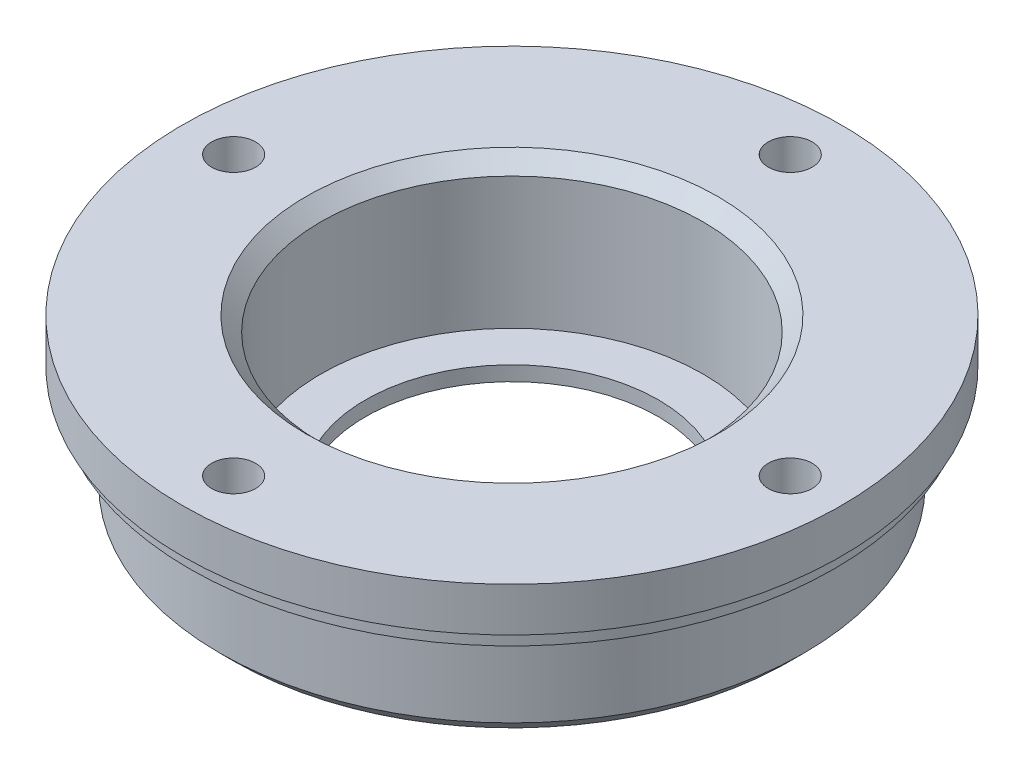
ISO-10303-21;
HEADER;
FILE_DESCRIPTION(('STEP AP214'),'2;1');
FILE_NAME('part.step','',(''),(''),'','','');
FILE_SCHEMA(('AUTOMOTIVE_DESIGN { 1 0 10303 214 1 1 1 1 }'));
ENDSEC;
DATA;
#1=APPLICATION_CONTEXT('core data for automotive mechanical design processes');
#2=APPLICATION_PROTOCOL_DEFINITION('international standard','automotive_design',2000,#1);
#3=PRODUCT_CONTEXT('',#1,'mechanical');
#4=PRODUCT('Part','Part','',(#3));
#5=PRODUCT_RELATED_PRODUCT_CATEGORY('part','',(#4));
#6=PRODUCT_DEFINITION_FORMATION('','',#4);
#7=PRODUCT_DEFINITION_CONTEXT('part definition',#1,'design');
#8=PRODUCT_DEFINITION('design','',#6,#7);
#9=PRODUCT_DEFINITION_SHAPE('','',#8);
#10=(LENGTH_UNIT() NAMED_UNIT(*) SI_UNIT(.MILLI.,.METRE.));
#11=(NAMED_UNIT(*) PLANE_ANGLE_UNIT() SI_UNIT($,.RADIAN.));
#12=(NAMED_UNIT(*) SI_UNIT($,.STERADIAN.) SOLID_ANGLE_UNIT());
#13=UNCERTAINTY_MEASURE_WITH_UNIT(LENGTH_MEASURE(1.E-05),#10,'distance_accuracy_value','');
#14=(GEOMETRIC_REPRESENTATION_CONTEXT(3) GLOBAL_UNCERTAINTY_ASSIGNED_CONTEXT((#13)) GLOBAL_UNIT_ASSIGNED_CONTEXT((#10,
#11,#12)) REPRESENTATION_CONTEXT('',''));
#15=CARTESIAN_POINT('',(0.,0.,0.));
#16=DIRECTION('',(0.,0.,1.));
#17=DIRECTION('',(1.,0.,0.));
#18=AXIS2_PLACEMENT_3D('',#15,#16,#17);
#19=CARTESIAN_POINT('',(0.,7.,0.));
#20=DIRECTION('',(0.,-1.,0.));
#21=DIRECTION('',(0.,0.,-1.));
#22=AXIS2_PLACEMENT_3D('',#19,#20,#21);
#23=CYLINDRICAL_SURFACE('',#22,13.05);
#24=CARTESIAN_POINT('',(0.,9.99999999999999,0.));
#25=DIRECTION('',(0.,1.,0.));
#26=DIRECTION('',(0.,0.,1.));
#27=AXIS2_PLACEMENT_3D('',#24,#25,#26);
#28=CIRCLE('',#27,13.05);
#29=CARTESIAN_POINT('',(0.,9.99999999999999,13.05));
#30=VERTEX_POINT('',#29);
#31=EDGE_CURVE('E120',#30,#30,#28,.T.);
#32=ORIENTED_EDGE('',*,*,#31,.T.);
#33=EDGE_LOOP('',(#32));
#34=FACE_BOUND('',#33,.T.);
#35=CARTESIAN_POINT('',(0.,1.,0.));
#36=DIRECTION('',(0.,-1.,0.));
#37=DIRECTION('',(0.,0.,-1.));
#38=AXIS2_PLACEMENT_3D('',#35,#36,#37);
#39=CIRCLE('',#38,13.05);
#40=CARTESIAN_POINT('',(0.,1.,-13.05));
#41=VERTEX_POINT('',#40);
#42=EDGE_CURVE('E113',#41,#41,#39,.T.);
#43=ORIENTED_EDGE('',*,*,#42,.T.);
#44=EDGE_LOOP('',(#43));
#45=FACE_BOUND('',#44,.T.);
#46=ADVANCED_FACE('F39',(#34,#45),#23,.F.);
#47=CARTESIAN_POINT('',(0.,0.,0.));
#48=DIRECTION('',(0.,1.,0.));
#49=DIRECTION('',(0.,0.,1.));
#50=AXIS2_PLACEMENT_3D('',#47,#48,#49);
#51=PLANE('',#50);
#52=CARTESIAN_POINT('',(0.,0.,0.));
#53=DIRECTION('',(0.,1.,0.));
#54=DIRECTION('',(0.,0.,1.));
#55=AXIS2_PLACEMENT_3D('',#52,#53,#54);
#56=CIRCLE('',#55,18.95);
#57=CARTESIAN_POINT('',(0.,0.,18.95));
#58=VERTEX_POINT('',#57);
#59=EDGE_CURVE('E117',#58,#58,#56,.F.);
#60=ORIENTED_EDGE('',*,*,#59,.T.);
#61=EDGE_LOOP('',(#60));
#62=FACE_BOUND('',#61,.T.);
#63=CARTESIAN_POINT('',(0.,0.,0.));
#64=DIRECTION('',(0.,-1.,0.));
#65=DIRECTION('',(0.,0.,-1.));
#66=AXIS2_PLACEMENT_3D('',#63,#64,#65);
#67=CIRCLE('',#66,10.);
#68=CARTESIAN_POINT('',(0.,0.,-10.));
#69=VERTEX_POINT('',#68);
#70=EDGE_CURVE('E144',#69,#69,#67,.T.);
#71=ORIENTED_EDGE('',*,*,#70,.F.);
#72=EDGE_LOOP('',(#71));
#73=FACE_BOUND('',#72,.T.);
#74=ADVANCED_FACE('F135',(#62,#73),#51,.F.);
#75=CARTESIAN_POINT('',(0.,7.,0.));
#76=DIRECTION('',(0.,-1.,0.));
#77=DIRECTION('',(0.,0.,-1.));
#78=AXIS2_PLACEMENT_3D('',#75,#76,#77);
#79=CYLINDRICAL_SURFACE('',#78,19.95);
#80=CARTESIAN_POINT('',(0.,1.00000000000001,0.));
#81=DIRECTION('',(0.,1.,0.));
#82=DIRECTION('',(0.,0.,1.));
#83=AXIS2_PLACEMENT_3D('',#80,#81,#82);
#84=CIRCLE('',#83,19.95);
#85=CARTESIAN_POINT('',(0.,1.00000000000001,19.95));
#86=VERTEX_POINT('',#85);
#87=EDGE_CURVE('E111',#86,#86,#84,.T.);
#88=ORIENTED_EDGE('',*,*,#87,.T.);
#89=EDGE_LOOP('',(#88));
#90=FACE_BOUND('',#89,.T.);
#91=CARTESIAN_POINT('',(0.,7.,0.));
#92=DIRECTION('',(0.,1.,0.));
#93=DIRECTION('',(0.,0.,1.));
#94=AXIS2_PLACEMENT_3D('',#91,#92,#93);
#95=CIRCLE('',#94,19.95);
#96=CARTESIAN_POINT('',(1.18895649671302,7.,19.9145394736841));
#97=VERTEX_POINT('',#96);
#98=CARTESIAN_POINT('',(19.9145394736842,7.,1.18895649671174));
#99=VERTEX_POINT('',#98);
#100=EDGE_CURVE('E108',#97,#99,#95,.T.);
#101=ORIENTED_EDGE('',*,*,#100,.F.);
#102=CARTESIAN_POINT('',(-1.18895649671069,7.,19.9145394736843));
#103=VERTEX_POINT('',#102);
#104=EDGE_CURVE('E112',#103,#97,#95,.T.);
#105=ORIENTED_EDGE('',*,*,#104,.F.);
#106=CARTESIAN_POINT('',(-19.9145394736842,7.,1.18895649671198));
#107=VERTEX_POINT('',#106);
#108=EDGE_CURVE('E142',#107,#103,#95,.T.);
#109=ORIENTED_EDGE('',*,*,#108,.F.);
#110=CARTESIAN_POINT('',(-19.9145394736843,7.,-1.18895649671082));
#111=VERTEX_POINT('',#110);
#112=EDGE_CURVE('E184',#111,#107,#95,.T.);
#113=ORIENTED_EDGE('',*,*,#112,.F.);
#114=CARTESIAN_POINT('',(-1.18895649671184,7.,-19.9145394736842));
#115=VERTEX_POINT('',#114);
#116=EDGE_CURVE('E98',#115,#111,#95,.T.);
#117=ORIENTED_EDGE('',*,*,#116,.F.);
#118=CARTESIAN_POINT('',(1.18895649671187,7.,-19.9145394736842));
#119=VERTEX_POINT('',#118);
#120=EDGE_CURVE('E81',#119,#115,#95,.T.);
#121=ORIENTED_EDGE('',*,*,#120,.F.);
#122=CARTESIAN_POINT('',(19.9145394736842,7.,-1.18895649671291));
#123=VERTEX_POINT('',#122);
#124=EDGE_CURVE('E96',#123,#119,#95,.T.);
#125=ORIENTED_EDGE('',*,*,#124,.F.);
#126=EDGE_CURVE('E106',#99,#123,#95,.T.);
#127=ORIENTED_EDGE('',*,*,#126,.F.);
#128=EDGE_LOOP('',(#101,#105,#109,#113,#117,#121,#125,#127));
#129=FACE_BOUND('',#128,.T.);
#130=ADVANCED_FACE('F94',(#90,#129),#79,.T.);
#131=CARTESIAN_POINT('',(0.,1.,0.));
#132=DIRECTION('',(0.,-1.,0.));
#133=DIRECTION('',(0.,0.,-1.));
#134=AXIS2_PLACEMENT_3D('',#131,#132,#133);
#135=PLANE('',#134);
#136=CARTESIAN_POINT('',(0.,1.,0.));
#137=DIRECTION('',(0.,-1.,0.));
#138=DIRECTION('',(0.,0.,-1.));
#139=AXIS2_PLACEMENT_3D('',#136,#137,#138);
#140=CIRCLE('',#139,10.);
#141=CARTESIAN_POINT('',(0.,1.,-10.));
#142=VERTEX_POINT('',#141);
#143=EDGE_CURVE('E140',#142,#142,#140,.T.);
#144=ORIENTED_EDGE('',*,*,#143,.T.);
#145=EDGE_LOOP('',(#144));
#146=FACE_BOUND('',#145,.T.);
#147=ORIENTED_EDGE('',*,*,#42,.F.);
#148=EDGE_LOOP('',(#147));
#149=FACE_BOUND('',#148,.T.);
#150=ADVANCED_FACE('F225',(#146,#149),#135,.F.);
#151=CARTESIAN_POINT('',(0.,1.,0.));
#152=DIRECTION('',(0.,-1.,0.));
#153=DIRECTION('',(0.,0.,-1.));
#154=AXIS2_PLACEMENT_3D('',#151,#152,#153);
#155=CYLINDRICAL_SURFACE('',#154,10.);
#156=ORIENTED_EDGE('',*,*,#143,.F.);
#157=EDGE_LOOP('',(#156));
#158=FACE_BOUND('',#157,.T.);
#159=ORIENTED_EDGE('',*,*,#70,.T.);
#160=EDGE_LOOP('',(#159));
#161=FACE_BOUND('',#160,.T.);
#162=ADVANCED_FACE('F219',(#158,#161),#155,.F.);
#163=CARTESIAN_POINT('',(0.,7.,0.));
#164=DIRECTION('',(0.,1.,0.));
#165=DIRECTION('',(0.,0.,1.));
#166=AXIS2_PLACEMENT_3D('',#163,#164,#165);
#167=PLANE('',#166);
#168=ORIENTED_EDGE('',*,*,#116,.T.);
#169=CARTESIAN_POINT('',(-18.9999999999994,7.,5.67025844789061E-13));
#170=DIRECTION('',(0.,1.,0.));
#171=DIRECTION('',(0.,0.,1.));
#172=AXIS2_PLACEMENT_3D('',#169,#170,#171);
#173=CIRCLE('',#172,1.5);
#174=EDGE_CURVE('E173',#111,#107,#173,.T.);
#175=ORIENTED_EDGE('',*,*,#174,.T.);
#176=ORIENTED_EDGE('',*,*,#108,.T.);
#177=CARTESIAN_POINT('',(1.12939803174136E-12,7.,19.));
#178=DIRECTION('',(0.,1.,0.));
#179=DIRECTION('',(0.,0.,1.));
#180=AXIS2_PLACEMENT_3D('',#177,#178,#179);
#181=CIRCLE('',#180,1.5);
#182=EDGE_CURVE('E11',#103,#97,#181,.T.);
#183=ORIENTED_EDGE('',*,*,#182,.T.);
#184=ORIENTED_EDGE('',*,*,#100,.T.);
#185=CARTESIAN_POINT('',(19.0000000000006,7.,-5.64699015870681E-13));
#186=DIRECTION('',(0.,1.,0.));
#187=DIRECTION('',(0.,0.,1.));
#188=AXIS2_PLACEMENT_3D('',#185,#186,#187);
#189=CIRCLE('',#188,1.5);
#190=EDGE_CURVE('E105',#99,#123,#189,.T.);
#191=ORIENTED_EDGE('',*,*,#190,.T.);
#192=ORIENTED_EDGE('',*,*,#124,.T.);
#193=CARTESIAN_POINT('',(0.,7.,-19.));
#194=DIRECTION('',(0.,1.,0.));
#195=DIRECTION('',(0.,0.,1.));
#196=AXIS2_PLACEMENT_3D('',#193,#194,#195);
#197=CIRCLE('',#196,1.5);
#198=EDGE_CURVE('E83',#119,#115,#197,.T.);
#199=ORIENTED_EDGE('',*,*,#198,.T.);
#200=EDGE_LOOP('',(#168,#175,#176,#183,#184,#191,#192,#199));
#201=FACE_BOUND('',#200,.T.);
#202=CARTESIAN_POINT('',(0.,7.,0.));
#203=DIRECTION('',(0.,1.,0.));
#204=DIRECTION('',(0.,0.,1.));
#205=AXIS2_PLACEMENT_3D('',#202,#203,#204);
#206=CIRCLE('',#205,22.);
#207=CARTESIAN_POINT('',(0.,7.,22.));
#208=VERTEX_POINT('',#207);
#209=EDGE_CURVE('E151',#208,#208,#206,.T.);
#210=ORIENTED_EDGE('',*,*,#209,.F.);
#211=EDGE_LOOP('',(#210));
#212=FACE_BOUND('',#211,.T.);
#213=ADVANCED_FACE('F101',(#201,#212),#167,.F.);
#214=CARTESIAN_POINT('',(0.,8.,0.));
#215=DIRECTION('',(0.,-1.,0.));
#216=DIRECTION('',(0.,0.,-1.));
#217=AXIS2_PLACEMENT_3D('',#214,#215,#216);
#218=CYLINDRICAL_SURFACE('',#217,22.);
#219=CARTESIAN_POINT('',(0.,8.,0.));
#220=DIRECTION('',(0.,1.,0.));
#221=DIRECTION('',(0.,0.,1.));
#222=AXIS2_PLACEMENT_3D('',#219,#220,#221);
#223=CIRCLE('',#222,22.);
#224=CARTESIAN_POINT('',(0.,8.,22.));
#225=VERTEX_POINT('',#224);
#226=EDGE_CURVE('E149',#225,#225,#223,.T.);
#227=ORIENTED_EDGE('',*,*,#226,.F.);
#228=EDGE_LOOP('',(#227));
#229=FACE_BOUND('',#228,.T.);
#230=ORIENTED_EDGE('',*,*,#209,.T.);
#231=EDGE_LOOP('',(#230));
#232=FACE_BOUND('',#231,.T.);
#233=ADVANCED_FACE('F212',(#229,#232),#218,.T.);
#234=CARTESIAN_POINT('',(0.,8.,0.));
#235=DIRECTION('',(0.,1.,0.));
#236=DIRECTION('',(0.,0.,1.));
#237=AXIS2_PLACEMENT_3D('',#234,#235,#236);
#238=PLANE('',#237);
#239=CARTESIAN_POINT('',(0.,8.,0.));
#240=DIRECTION('',(0.,1.,0.));
#241=DIRECTION('',(0.,0.,1.));
#242=AXIS2_PLACEMENT_3D('',#239,#240,#241);
#243=CIRCLE('',#242,22.5);
#244=CARTESIAN_POINT('',(0.,8.,22.5));
#245=VERTEX_POINT('',#244);
#246=EDGE_CURVE('E157',#245,#245,#243,.T.);
#247=ORIENTED_EDGE('',*,*,#246,.F.);
#248=EDGE_LOOP('',(#247));
#249=FACE_BOUND('',#248,.T.);
#250=ORIENTED_EDGE('',*,*,#226,.T.);
#251=EDGE_LOOP('',(#250));
#252=FACE_BOUND('',#251,.T.);
#253=ADVANCED_FACE('F209',(#249,#252),#238,.F.);
#254=CARTESIAN_POINT('',(0.,11.,0.));
#255=DIRECTION('',(0.,1.,0.));
#256=DIRECTION('',(0.,0.,1.));
#257=AXIS2_PLACEMENT_3D('',#254,#255,#256);
#258=PLANE('',#257);
#259=CARTESIAN_POINT('',(0.,11.,0.));
#260=DIRECTION('',(0.,1.,0.));
#261=DIRECTION('',(0.,0.,1.));
#262=AXIS2_PLACEMENT_3D('',#259,#260,#261);
#263=CIRCLE('',#262,14.05);
#264=CARTESIAN_POINT('',(0.,11.,14.05));
#265=VERTEX_POINT('',#264);
#266=EDGE_CURVE('E48',#265,#265,#263,.F.);
#267=ORIENTED_EDGE('',*,*,#266,.T.);
#268=EDGE_LOOP('',(#267));
#269=FACE_BOUND('',#268,.T.);
#270=CARTESIAN_POINT('',(1.12939803174136E-12,11.,19.));
#271=DIRECTION('',(0.,1.,0.));
#272=DIRECTION('',(0.,0.,1.));
#273=AXIS2_PLACEMENT_3D('',#270,#271,#272);
#274=CIRCLE('',#273,1.5);
#275=CARTESIAN_POINT('',(1.12939803174136E-12,11.,20.5));
#276=VERTEX_POINT('',#275);
#277=EDGE_CURVE('E168',#276,#276,#274,.T.);
#278=ORIENTED_EDGE('',*,*,#277,.F.);
#279=EDGE_LOOP('',(#278));
#280=FACE_BOUND('',#279,.T.);
#281=CARTESIAN_POINT('',(0.,11.,0.));
#282=DIRECTION('',(0.,1.,0.));
#283=DIRECTION('',(0.,0.,1.));
#284=AXIS2_PLACEMENT_3D('',#281,#282,#283);
#285=CIRCLE('',#284,22.5);
#286=CARTESIAN_POINT('',(0.,11.,22.5));
#287=VERTEX_POINT('',#286);
#288=EDGE_CURVE('E154',#287,#287,#285,.T.);
#289=ORIENTED_EDGE('',*,*,#288,.T.);
#290=EDGE_LOOP('',(#289));
#291=FACE_BOUND('',#290,.T.);
#292=CARTESIAN_POINT('',(0.,11.,-19.));
#293=DIRECTION('',(0.,1.,0.));
#294=DIRECTION('',(0.,0.,1.));
#295=AXIS2_PLACEMENT_3D('',#292,#293,#294);
#296=CIRCLE('',#295,1.5);
#297=CARTESIAN_POINT('',(0.,11.,-17.5));
#298=VERTEX_POINT('',#297);
#299=EDGE_CURVE('E160',#298,#298,#296,.T.);
#300=ORIENTED_EDGE('',*,*,#299,.F.);
#301=EDGE_LOOP('',(#300));
#302=FACE_BOUND('',#301,.T.);
#303=CARTESIAN_POINT('',(19.0000000000006,11.,-5.64699015870681E-13));
#304=DIRECTION('',(0.,1.,0.));
#305=DIRECTION('',(0.,0.,1.));
#306=AXIS2_PLACEMENT_3D('',#303,#304,#305);
#307=CIRCLE('',#306,1.5);
#308=CARTESIAN_POINT('',(19.0000000000006,11.,1.49999999999944));
#309=VERTEX_POINT('',#308);
#310=EDGE_CURVE('E165',#309,#309,#307,.T.);
#311=ORIENTED_EDGE('',*,*,#310,.F.);
#312=EDGE_LOOP('',(#311));
#313=FACE_BOUND('',#312,.T.);
#314=CARTESIAN_POINT('',(-18.9999999999994,11.,5.67025844789061E-13));
#315=DIRECTION('',(0.,1.,0.));
#316=DIRECTION('',(0.,0.,1.));
#317=AXIS2_PLACEMENT_3D('',#314,#315,#316);
#318=CIRCLE('',#317,1.5);
#319=CARTESIAN_POINT('',(-18.9999999999994,11.,1.50000000000057));
#320=VERTEX_POINT('',#319);
#321=EDGE_CURVE('E171',#320,#320,#318,.T.);
#322=ORIENTED_EDGE('',*,*,#321,.F.);
#323=EDGE_LOOP('',(#322));
#324=FACE_BOUND('',#323,.T.);
#325=ADVANCED_FACE('F125',(#269,#280,#291,#302,#313,#324),#258,.T.);
#326=CARTESIAN_POINT('',(0.,11.,0.));
#327=DIRECTION('',(0.,-1.,0.));
#328=DIRECTION('',(0.,0.,-1.));
#329=AXIS2_PLACEMENT_3D('',#326,#327,#328);
#330=CYLINDRICAL_SURFACE('',#329,22.5);
#331=ORIENTED_EDGE('',*,*,#288,.F.);
#332=EDGE_LOOP('',(#331));
#333=FACE_BOUND('',#332,.T.);
#334=ORIENTED_EDGE('',*,*,#246,.T.);
#335=EDGE_LOOP('',(#334));
#336=FACE_BOUND('',#335,.T.);
#337=ADVANCED_FACE('F202',(#333,#336),#330,.T.);
#338=CARTESIAN_POINT('',(0.,11.,-19.));
#339=DIRECTION('',(0.,-1.,0.));
#340=DIRECTION('',(0.,0.,-1.));
#341=AXIS2_PLACEMENT_3D('',#338,#339,#340);
#342=CYLINDRICAL_SURFACE('',#341,1.5);
#343=ORIENTED_EDGE('',*,*,#299,.T.);
#344=EDGE_LOOP('',(#343));
#345=FACE_BOUND('',#344,.T.);
#346=ORIENTED_EDGE('',*,*,#198,.F.);
#347=EDGE_CURVE('E61',#115,#119,#197,.T.);
#348=ORIENTED_EDGE('',*,*,#347,.F.);
#349=EDGE_LOOP('',(#346,#348));
#350=FACE_BOUND('',#349,.T.);
#351=ADVANCED_FACE('F85',(#345,#350),#342,.F.);
#352=CARTESIAN_POINT('',(19.0000000000006,11.,-5.64699015870681E-13));
#353=DIRECTION('',(0.,-1.,0.));
#354=DIRECTION('',(0.,0.,-1.));
#355=AXIS2_PLACEMENT_3D('',#352,#353,#354);
#356=CYLINDRICAL_SURFACE('',#355,1.5);
#357=ORIENTED_EDGE('',*,*,#310,.T.);
#358=EDGE_LOOP('',(#357));
#359=FACE_BOUND('',#358,.T.);
#360=ORIENTED_EDGE('',*,*,#190,.F.);
#361=EDGE_CURVE('E90',#123,#99,#189,.T.);
#362=ORIENTED_EDGE('',*,*,#361,.F.);
#363=EDGE_LOOP('',(#360,#362));
#364=FACE_BOUND('',#363,.T.);
#365=ADVANCED_FACE('F191',(#359,#364),#356,.F.);
#366=CARTESIAN_POINT('',(1.12939803174136E-12,11.,19.));
#367=DIRECTION('',(0.,-1.,0.));
#368=DIRECTION('',(0.,0.,-1.));
#369=AXIS2_PLACEMENT_3D('',#366,#367,#368);
#370=CYLINDRICAL_SURFACE('',#369,1.5);
#371=ORIENTED_EDGE('',*,*,#277,.T.);
#372=EDGE_LOOP('',(#371));
#373=FACE_BOUND('',#372,.T.);
#374=CARTESIAN_POINT('',(1.12939803174136E-12,7.,19.));
#375=DIRECTION('',(0.,1.,0.));
#376=DIRECTION('',(0.,0.,1.));
#377=AXIS2_PLACEMENT_3D('',#374,#375,#376);
#378=CIRCLE('',#377,1.5);
#379=EDGE_CURVE('E176',#97,#103,#378,.T.);
#380=ORIENTED_EDGE('',*,*,#379,.F.);
#381=ORIENTED_EDGE('',*,*,#182,.F.);
#382=EDGE_LOOP('',(#380,#381));
#383=FACE_BOUND('',#382,.T.);
#384=ADVANCED_FACE('F193',(#373,#383),#370,.F.);
#385=CARTESIAN_POINT('',(-18.9999999999994,11.,5.67025844789061E-13));
#386=DIRECTION('',(0.,-1.,0.));
#387=DIRECTION('',(0.,0.,-1.));
#388=AXIS2_PLACEMENT_3D('',#385,#386,#387);
#389=CYLINDRICAL_SURFACE('',#388,1.5);
#390=ORIENTED_EDGE('',*,*,#321,.T.);
#391=EDGE_LOOP('',(#390));
#392=FACE_BOUND('',#391,.T.);
#393=ORIENTED_EDGE('',*,*,#174,.F.);
#394=EDGE_CURVE('E54',#107,#111,#173,.T.);
#395=ORIENTED_EDGE('',*,*,#394,.F.);
#396=EDGE_LOOP('',(#393,#395));
#397=FACE_BOUND('',#396,.T.);
#398=ADVANCED_FACE('F185',(#392,#397),#389,.F.);
#399=CARTESIAN_POINT('',(0.,1.00000000000001,0.));
#400=DIRECTION('',(0.,1.,0.));
#401=DIRECTION('',(0.,0.,1.));
#402=AXIS2_PLACEMENT_3D('',#399,#400,#401);
#403=CONICAL_SURFACE('',#402,19.95,0.785398163397448);
#404=ORIENTED_EDGE('',*,*,#59,.F.);
#405=EDGE_LOOP('',(#404));
#406=FACE_BOUND('',#405,.T.);
#407=ORIENTED_EDGE('',*,*,#87,.F.);
#408=EDGE_LOOP('',(#407));
#409=FACE_BOUND('',#408,.T.);
#410=ADVANCED_FACE('F130',(#406,#409),#403,.T.);
#411=CARTESIAN_POINT('',(0.,9.99999999999999,0.));
#412=DIRECTION('',(0.,1.,0.));
#413=DIRECTION('',(0.,0.,1.));
#414=AXIS2_PLACEMENT_3D('',#411,#412,#413);
#415=CONICAL_SURFACE('',#414,13.05,0.785398163397447);
#416=ORIENTED_EDGE('',*,*,#266,.F.);
#417=EDGE_LOOP('',(#416));
#418=FACE_BOUND('',#417,.T.);
#419=ORIENTED_EDGE('',*,*,#31,.F.);
#420=EDGE_LOOP('',(#419));
#421=FACE_BOUND('',#420,.T.);
#422=ADVANCED_FACE('F42',(#418,#421),#415,.F.);
#423=CARTESIAN_POINT('',(0.,7.,-19.));
#424=DIRECTION('',(0.,1.,0.));
#425=DIRECTION('',(0.,0.,1.));
#426=AXIS2_PLACEMENT_3D('',#423,#424,#425);
#427=PLANE('',#426);
#428=ORIENTED_EDGE('',*,*,#120,.T.);
#429=ORIENTED_EDGE('',*,*,#347,.T.);
#430=EDGE_LOOP('',(#428,#429));
#431=FACE_BOUND('',#430,.T.);
#432=ADVANCED_FACE('F79',(#431),#427,.T.);
#433=CARTESIAN_POINT('',(19.0000000000006,7.,-5.64699015870681E-13));
#434=DIRECTION('',(0.,1.,0.));
#435=DIRECTION('',(0.,0.,1.));
#436=AXIS2_PLACEMENT_3D('',#433,#434,#435);
#437=PLANE('',#436);
#438=ORIENTED_EDGE('',*,*,#126,.T.);
#439=ORIENTED_EDGE('',*,*,#361,.T.);
#440=EDGE_LOOP('',(#438,#439));
#441=FACE_BOUND('',#440,.T.);
#442=ADVANCED_FACE('F189',(#441),#437,.T.);
#443=CARTESIAN_POINT('',(1.12939803174136E-12,7.,19.));
#444=DIRECTION('',(0.,1.,0.));
#445=DIRECTION('',(0.,0.,1.));
#446=AXIS2_PLACEMENT_3D('',#443,#444,#445);
#447=PLANE('',#446);
#448=ORIENTED_EDGE('',*,*,#104,.T.);
#449=ORIENTED_EDGE('',*,*,#379,.T.);
#450=EDGE_LOOP('',(#448,#449));
#451=FACE_BOUND('',#450,.T.);
#452=ADVANCED_FACE('F256',(#451),#447,.T.);
#453=CARTESIAN_POINT('',(-18.9999999999994,7.,5.67025844789061E-13));
#454=DIRECTION('',(0.,1.,0.));
#455=DIRECTION('',(0.,0.,1.));
#456=AXIS2_PLACEMENT_3D('',#453,#454,#455);
#457=PLANE('',#456);
#458=ORIENTED_EDGE('',*,*,#112,.T.);
#459=ORIENTED_EDGE('',*,*,#394,.T.);
#460=EDGE_LOOP('',(#458,#459));
#461=FACE_BOUND('',#460,.T.);
#462=ADVANCED_FACE('F183',(#461),#457,.T.);
#463=CLOSED_SHELL('',(#46,#74,#130,#150,#162,#213,#233,#253,#325,#337,#351,#365,#384,#398,#410,
#422,#432,#442,#452,#462));
#464=MANIFOLD_SOLID_BREP('B2',#463);
#465=ADVANCED_BREP_SHAPE_REPRESENTATION('',(#18,#464),#14);
#466=SHAPE_DEFINITION_REPRESENTATION(#9,#465);
ENDSEC;
END-ISO-10303-21;
